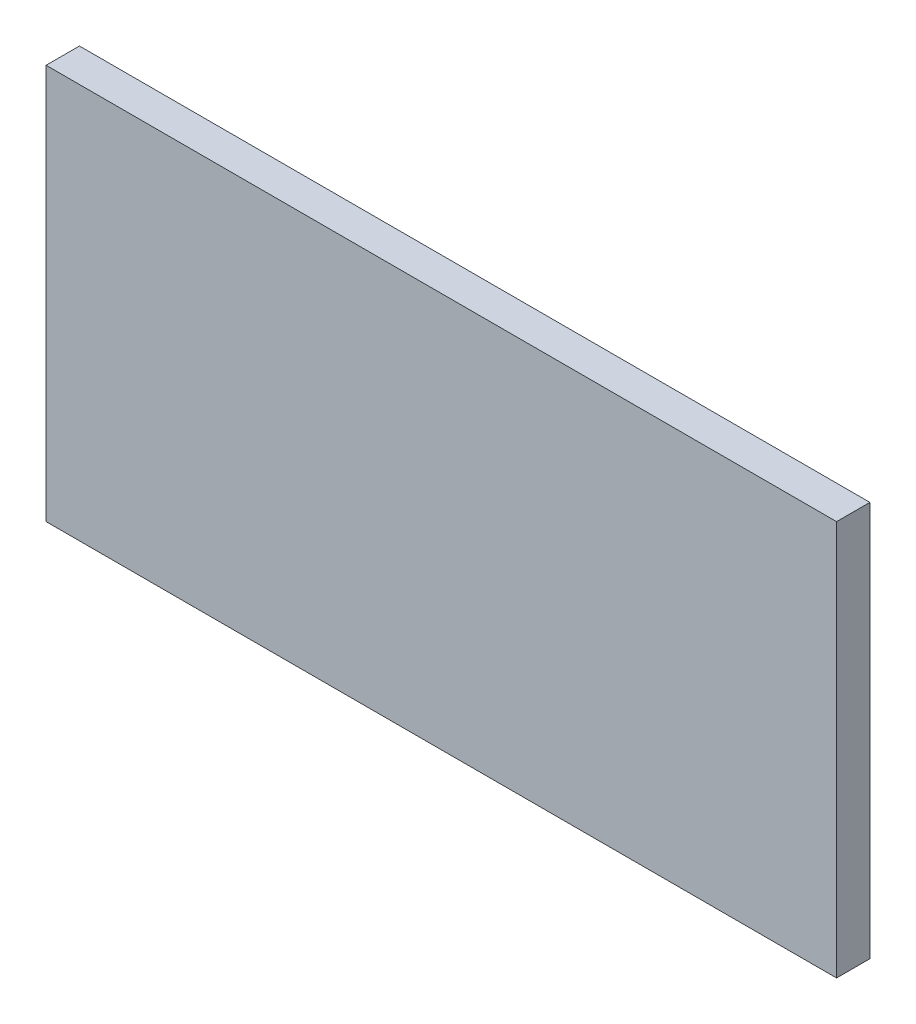
ISO-10303-21;
HEADER;
FILE_DESCRIPTION(('STEP AP214'),'2;1');
FILE_NAME('part.step','',(''),(''),'','','');
FILE_SCHEMA(('AUTOMOTIVE_DESIGN { 1 0 10303 214 1 1 1 1 }'));
ENDSEC;
DATA;
#1=APPLICATION_CONTEXT('core data for automotive mechanical design processes');
#2=APPLICATION_PROTOCOL_DEFINITION('international standard','automotive_design',2000,#1);
#3=PRODUCT_CONTEXT('',#1,'mechanical');
#4=PRODUCT('Part','Part','',(#3));
#5=PRODUCT_RELATED_PRODUCT_CATEGORY('part','',(#4));
#6=PRODUCT_DEFINITION_FORMATION('','',#4);
#7=PRODUCT_DEFINITION_CONTEXT('part definition',#1,'design');
#8=PRODUCT_DEFINITION('design','',#6,#7);
#9=PRODUCT_DEFINITION_SHAPE('','',#8);
#10=(LENGTH_UNIT() NAMED_UNIT(*) SI_UNIT(.MILLI.,.METRE.));
#11=(NAMED_UNIT(*) PLANE_ANGLE_UNIT() SI_UNIT($,.RADIAN.));
#12=(NAMED_UNIT(*) SI_UNIT($,.STERADIAN.) SOLID_ANGLE_UNIT());
#13=UNCERTAINTY_MEASURE_WITH_UNIT(LENGTH_MEASURE(1.E-05),#10,'distance_accuracy_value','');
#14=(GEOMETRIC_REPRESENTATION_CONTEXT(3) GLOBAL_UNCERTAINTY_ASSIGNED_CONTEXT((#13)) GLOBAL_UNIT_ASSIGNED_CONTEXT((#10,
#11,#12)) REPRESENTATION_CONTEXT('',''));
#15=CARTESIAN_POINT('',(0.,0.,0.));
#16=DIRECTION('',(0.,0.,1.));
#17=DIRECTION('',(1.,0.,0.));
#18=AXIS2_PLACEMENT_3D('',#15,#16,#17);
#19=CARTESIAN_POINT('',(-17.78,-8.89,1.5));
#20=DIRECTION('',(1.,0.,0.));
#21=DIRECTION('',(0.,0.,-1.));
#22=AXIS2_PLACEMENT_3D('',#19,#20,#21);
#23=PLANE('',#22);
#24=DIRECTION('',(0.,-1.,0.));
#25=VECTOR('',#24,1.);
#26=CARTESIAN_POINT('',(-17.78,-8.89,0.));
#27=LINE('',#26,#25);
#28=CARTESIAN_POINT('',(-17.78,8.89,0.));
#29=VERTEX_POINT('',#28);
#30=CARTESIAN_POINT('',(-17.78,-8.89,0.));
#31=VERTEX_POINT('',#30);
#32=EDGE_CURVE('E98',#29,#31,#27,.T.);
#33=ORIENTED_EDGE('',*,*,#32,.T.);
#34=DIRECTION('',(0.,0.,-1.));
#35=VECTOR('',#34,1.);
#36=CARTESIAN_POINT('',(-17.78,-8.89,1.5));
#37=LINE('',#36,#35);
#38=CARTESIAN_POINT('',(-17.78,-8.89,1.5));
#39=VERTEX_POINT('',#38);
#40=EDGE_CURVE('E11',#39,#31,#37,.T.);
#41=ORIENTED_EDGE('',*,*,#40,.F.);
#42=DIRECTION('',(0.,-1.,0.));
#43=VECTOR('',#42,1.);
#44=CARTESIAN_POINT('',(-17.78,-8.89,1.5));
#45=LINE('',#44,#43);
#46=CARTESIAN_POINT('',(-17.78,8.89,1.5));
#47=VERTEX_POINT('',#46);
#48=EDGE_CURVE('E86',#47,#39,#45,.T.);
#49=ORIENTED_EDGE('',*,*,#48,.F.);
#50=DIRECTION('',(0.,0.,-1.));
#51=VECTOR('',#50,1.);
#52=CARTESIAN_POINT('',(-17.78,8.89,1.5));
#53=LINE('',#52,#51);
#54=EDGE_CURVE('E94',#47,#29,#53,.T.);
#55=ORIENTED_EDGE('',*,*,#54,.T.);
#56=EDGE_LOOP('',(#33,#41,#49,#55));
#57=FACE_BOUND('',#56,.T.);
#58=ADVANCED_FACE('F35',(#57),#23,.F.);
#59=CARTESIAN_POINT('',(17.78,-8.89,1.5));
#60=DIRECTION('',(0.,1.,0.));
#61=DIRECTION('',(-1.,0.,0.));
#62=AXIS2_PLACEMENT_3D('',#59,#60,#61);
#63=PLANE('',#62);
#64=DIRECTION('',(1.,0.,0.));
#65=VECTOR('',#64,1.);
#66=CARTESIAN_POINT('',(17.78,-8.89,0.));
#67=LINE('',#66,#65);
#68=CARTESIAN_POINT('',(17.78,-8.89,0.));
#69=VERTEX_POINT('',#68);
#70=EDGE_CURVE('E90',#31,#69,#67,.T.);
#71=ORIENTED_EDGE('',*,*,#70,.T.);
#72=DIRECTION('',(0.,0.,-1.));
#73=VECTOR('',#72,1.);
#74=CARTESIAN_POINT('',(17.78,-8.89,1.5));
#75=LINE('',#74,#73);
#76=CARTESIAN_POINT('',(17.78,-8.89,1.5));
#77=VERTEX_POINT('',#76);
#78=EDGE_CURVE('E43',#77,#69,#75,.T.);
#79=ORIENTED_EDGE('',*,*,#78,.F.);
#80=DIRECTION('',(1.,0.,0.));
#81=VECTOR('',#80,1.);
#82=CARTESIAN_POINT('',(17.78,-8.89,1.5));
#83=LINE('',#82,#81);
#84=EDGE_CURVE('E81',#39,#77,#83,.T.);
#85=ORIENTED_EDGE('',*,*,#84,.F.);
#86=ORIENTED_EDGE('',*,*,#40,.T.);
#87=EDGE_LOOP('',(#71,#79,#85,#86));
#88=FACE_BOUND('',#87,.T.);
#89=ADVANCED_FACE('F89',(#88),#63,.F.);
#90=CARTESIAN_POINT('',(17.78,-8.89,1.5));
#91=DIRECTION('',(-1.,0.,0.));
#92=DIRECTION('',(0.,0.,1.));
#93=AXIS2_PLACEMENT_3D('',#90,#91,#92);
#94=PLANE('',#93);
#95=DIRECTION('',(0.,1.,0.));
#96=VECTOR('',#95,1.);
#97=CARTESIAN_POINT('',(17.78,-8.89,0.));
#98=LINE('',#97,#96);
#99=CARTESIAN_POINT('',(17.78,8.89,0.));
#100=VERTEX_POINT('',#99);
#101=EDGE_CURVE('E68',#69,#100,#98,.T.);
#102=ORIENTED_EDGE('',*,*,#101,.T.);
#103=DIRECTION('',(0.,0.,-1.));
#104=VECTOR('',#103,1.);
#105=CARTESIAN_POINT('',(17.78,8.89,1.5));
#106=LINE('',#105,#104);
#107=CARTESIAN_POINT('',(17.78,8.89,1.5));
#108=VERTEX_POINT('',#107);
#109=EDGE_CURVE('E91',#108,#100,#106,.T.);
#110=ORIENTED_EDGE('',*,*,#109,.F.);
#111=DIRECTION('',(0.,1.,0.));
#112=VECTOR('',#111,1.);
#113=CARTESIAN_POINT('',(17.78,-8.89,1.5));
#114=LINE('',#113,#112);
#115=EDGE_CURVE('E84',#77,#108,#114,.T.);
#116=ORIENTED_EDGE('',*,*,#115,.F.);
#117=ORIENTED_EDGE('',*,*,#78,.T.);
#118=EDGE_LOOP('',(#102,#110,#116,#117));
#119=FACE_BOUND('',#118,.T.);
#120=ADVANCED_FACE('F92',(#119),#94,.F.);
#121=CARTESIAN_POINT('',(17.78,8.89,1.5));
#122=DIRECTION('',(0.,-1.,0.));
#123=DIRECTION('',(1.,0.,0.));
#124=AXIS2_PLACEMENT_3D('',#121,#122,#123);
#125=PLANE('',#124);
#126=DIRECTION('',(-1.,0.,0.));
#127=VECTOR('',#126,1.);
#128=CARTESIAN_POINT('',(17.78,8.89,0.));
#129=LINE('',#128,#127);
#130=EDGE_CURVE('E74',#100,#29,#129,.T.);
#131=ORIENTED_EDGE('',*,*,#130,.T.);
#132=ORIENTED_EDGE('',*,*,#54,.F.);
#133=DIRECTION('',(-1.,0.,0.));
#134=VECTOR('',#133,1.);
#135=CARTESIAN_POINT('',(17.78,8.89,1.5));
#136=LINE('',#135,#134);
#137=EDGE_CURVE('E51',#108,#47,#136,.T.);
#138=ORIENTED_EDGE('',*,*,#137,.F.);
#139=ORIENTED_EDGE('',*,*,#109,.T.);
#140=EDGE_LOOP('',(#131,#132,#138,#139));
#141=FACE_BOUND('',#140,.T.);
#142=ADVANCED_FACE('F105',(#141),#125,.F.);
#143=CARTESIAN_POINT('',(0.,0.,1.5));
#144=DIRECTION('',(0.,0.,1.));
#145=DIRECTION('',(1.,0.,0.));
#146=AXIS2_PLACEMENT_3D('',#143,#144,#145);
#147=PLANE('',#146);
#148=ORIENTED_EDGE('',*,*,#48,.T.);
#149=ORIENTED_EDGE('',*,*,#84,.T.);
#150=ORIENTED_EDGE('',*,*,#115,.T.);
#151=ORIENTED_EDGE('',*,*,#137,.T.);
#152=EDGE_LOOP('',(#148,#149,#150,#151));
#153=FACE_BOUND('',#152,.T.);
#154=ADVANCED_FACE('F82',(#153),#147,.T.);
#155=CARTESIAN_POINT('',(0.,0.,0.));
#156=DIRECTION('',(0.,0.,1.));
#157=DIRECTION('',(1.,0.,0.));
#158=AXIS2_PLACEMENT_3D('',#155,#156,#157);
#159=PLANE('',#158);
#160=ORIENTED_EDGE('',*,*,#32,.F.);
#161=ORIENTED_EDGE('',*,*,#130,.F.);
#162=ORIENTED_EDGE('',*,*,#101,.F.);
#163=ORIENTED_EDGE('',*,*,#70,.F.);
#164=EDGE_LOOP('',(#160,#161,#162,#163));
#165=FACE_BOUND('',#164,.T.);
#166=ADVANCED_FACE('F108',(#165),#159,.F.);
#167=CLOSED_SHELL('',(#58,#89,#120,#142,#154,#166));
#168=MANIFOLD_SOLID_BREP('B2',#167);
#169=ADVANCED_BREP_SHAPE_REPRESENTATION('',(#18,#168),#14);
#170=SHAPE_DEFINITION_REPRESENTATION(#9,#169);
ENDSEC;
END-ISO-10303-21;
